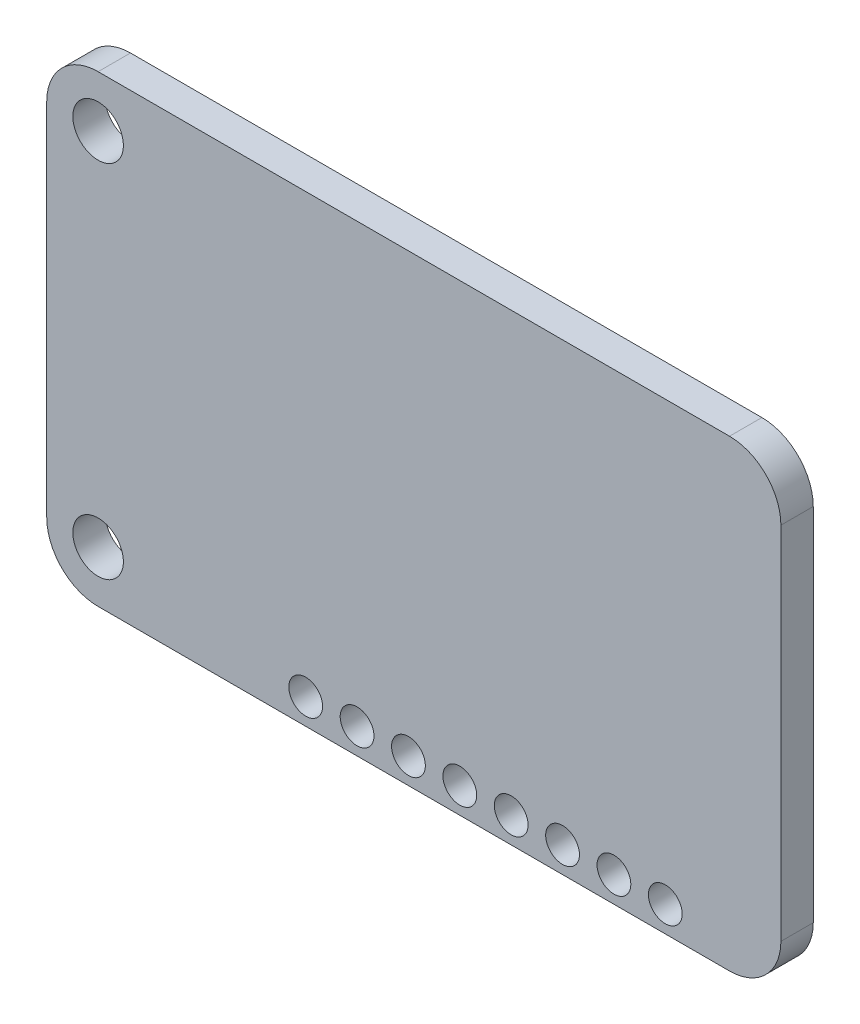
ISO-10303-21;
HEADER;
FILE_DESCRIPTION(('STEP AP214'),'2;1');
FILE_NAME('part.step','',(''),(''),'','','');
FILE_SCHEMA(('AUTOMOTIVE_DESIGN { 1 0 10303 214 1 1 1 1 }'));
ENDSEC;
DATA;
#1=APPLICATION_CONTEXT('core data for automotive mechanical design processes');
#2=APPLICATION_PROTOCOL_DEFINITION('international standard','automotive_design',2000,#1);
#3=PRODUCT_CONTEXT('',#1,'mechanical');
#4=PRODUCT('Part','Part','',(#3));
#5=PRODUCT_RELATED_PRODUCT_CATEGORY('part','',(#4));
#6=PRODUCT_DEFINITION_FORMATION('','',#4);
#7=PRODUCT_DEFINITION_CONTEXT('part definition',#1,'design');
#8=PRODUCT_DEFINITION('design','',#6,#7);
#9=PRODUCT_DEFINITION_SHAPE('','',#8);
#10=(LENGTH_UNIT() NAMED_UNIT(*) SI_UNIT(.MILLI.,.METRE.));
#11=(NAMED_UNIT(*) PLANE_ANGLE_UNIT() SI_UNIT($,.RADIAN.));
#12=(NAMED_UNIT(*) SI_UNIT($,.STERADIAN.) SOLID_ANGLE_UNIT());
#13=UNCERTAINTY_MEASURE_WITH_UNIT(LENGTH_MEASURE(1.E-05),#10,'distance_accuracy_value','');
#14=(GEOMETRIC_REPRESENTATION_CONTEXT(3) GLOBAL_UNCERTAINTY_ASSIGNED_CONTEXT((#13)) GLOBAL_UNIT_ASSIGNED_CONTEXT((#10,
#11,#12)) REPRESENTATION_CONTEXT('',''));
#15=CARTESIAN_POINT('',(0.,0.,0.));
#16=DIRECTION('',(0.,0.,1.));
#17=DIRECTION('',(1.,0.,0.));
#18=AXIS2_PLACEMENT_3D('',#15,#16,#17);
#19=CARTESIAN_POINT('',(15.61,-8.91,1.6));
#20=DIRECTION('',(0.,0.,1.));
#21=DIRECTION('',(1.,0.,0.));
#22=AXIS2_PLACEMENT_3D('',#19,#20,#21);
#23=PLANE('',#22);
#24=CARTESIAN_POINT('',(12.4347,-10.18,1.6));
#25=DIRECTION('',(0.,0.,1.));
#26=DIRECTION('',(1.,0.,0.));
#27=AXIS2_PLACEMENT_3D('',#24,#25,#26);
#28=CIRCLE('',#27,0.835000000000003);
#29=CARTESIAN_POINT('',(13.2697,-10.18,1.6));
#30=VERTEX_POINT('',#29);
#31=EDGE_CURVE('E163',#30,#30,#28,.T.);
#32=ORIENTED_EDGE('',*,*,#31,.F.);
#33=EDGE_LOOP('',(#32));
#34=FACE_BOUND('',#33,.T.);
#35=CARTESIAN_POINT('',(9.8947,-10.18,1.6));
#36=DIRECTION('',(0.,0.,1.));
#37=DIRECTION('',(1.,0.,0.));
#38=AXIS2_PLACEMENT_3D('',#35,#36,#37);
#39=CIRCLE('',#38,0.835000000000003);
#40=CARTESIAN_POINT('',(10.7297,-10.18,1.6));
#41=VERTEX_POINT('',#40);
#42=EDGE_CURVE('E282',#41,#41,#39,.T.);
#43=ORIENTED_EDGE('',*,*,#42,.F.);
#44=EDGE_LOOP('',(#43));
#45=FACE_BOUND('',#44,.T.);
#46=CARTESIAN_POINT('',(7.3547,-10.18,1.6));
#47=DIRECTION('',(0.,0.,1.));
#48=DIRECTION('',(1.,0.,0.));
#49=AXIS2_PLACEMENT_3D('',#46,#47,#48);
#50=CIRCLE('',#49,0.835000000000004);
#51=CARTESIAN_POINT('',(8.18970000000001,-10.18,1.6));
#52=VERTEX_POINT('',#51);
#53=EDGE_CURVE('E285',#52,#52,#50,.T.);
#54=ORIENTED_EDGE('',*,*,#53,.F.);
#55=EDGE_LOOP('',(#54));
#56=FACE_BOUND('',#55,.T.);
#57=CARTESIAN_POINT('',(4.8147,-10.18,1.6));
#58=DIRECTION('',(0.,0.,1.));
#59=DIRECTION('',(1.,0.,0.));
#60=AXIS2_PLACEMENT_3D('',#57,#58,#59);
#61=CIRCLE('',#60,0.835000000000003);
#62=CARTESIAN_POINT('',(5.64970000000001,-10.18,1.6));
#63=VERTEX_POINT('',#62);
#64=EDGE_CURVE('E290',#63,#63,#61,.T.);
#65=ORIENTED_EDGE('',*,*,#64,.F.);
#66=EDGE_LOOP('',(#65));
#67=FACE_BOUND('',#66,.T.);
#68=CARTESIAN_POINT('',(2.2747,-10.18,1.6));
#69=DIRECTION('',(0.,0.,1.));
#70=DIRECTION('',(1.,0.,0.));
#71=AXIS2_PLACEMENT_3D('',#68,#69,#70);
#72=CIRCLE('',#71,0.835000000000003);
#73=CARTESIAN_POINT('',(3.10970000000001,-10.18,1.6));
#74=VERTEX_POINT('',#73);
#75=EDGE_CURVE('E293',#74,#74,#72,.T.);
#76=ORIENTED_EDGE('',*,*,#75,.F.);
#77=EDGE_LOOP('',(#76));
#78=FACE_BOUND('',#77,.T.);
#79=CARTESIAN_POINT('',(-0.265299999999998,-10.18,1.6));
#80=DIRECTION('',(0.,0.,1.));
#81=DIRECTION('',(1.,0.,0.));
#82=AXIS2_PLACEMENT_3D('',#79,#80,#81);
#83=CIRCLE('',#82,0.835000000000003);
#84=CARTESIAN_POINT('',(0.569700000000005,-10.18,1.6));
#85=VERTEX_POINT('',#84);
#86=EDGE_CURVE('E296',#85,#85,#83,.T.);
#87=ORIENTED_EDGE('',*,*,#86,.F.);
#88=EDGE_LOOP('',(#87));
#89=FACE_BOUND('',#88,.T.);
#90=CARTESIAN_POINT('',(-2.8053,-10.18,1.6));
#91=DIRECTION('',(0.,0.,1.));
#92=DIRECTION('',(1.,0.,0.));
#93=AXIS2_PLACEMENT_3D('',#90,#91,#92);
#94=CIRCLE('',#93,0.835000000000003);
#95=CARTESIAN_POINT('',(-1.97029999999999,-10.18,1.6));
#96=VERTEX_POINT('',#95);
#97=EDGE_CURVE('E299',#96,#96,#94,.T.);
#98=ORIENTED_EDGE('',*,*,#97,.F.);
#99=EDGE_LOOP('',(#98));
#100=FACE_BOUND('',#99,.T.);
#101=CARTESIAN_POINT('',(-5.3453,-10.18,1.6));
#102=DIRECTION('',(0.,0.,1.));
#103=DIRECTION('',(1.,0.,0.));
#104=AXIS2_PLACEMENT_3D('',#101,#102,#103);
#105=CIRCLE('',#104,0.835000000000003);
#106=CARTESIAN_POINT('',(-4.51029999999999,-10.18,1.6));
#107=VERTEX_POINT('',#106);
#108=EDGE_CURVE('E301',#107,#107,#105,.T.);
#109=ORIENTED_EDGE('',*,*,#108,.F.);
#110=EDGE_LOOP('',(#109));
#111=FACE_BOUND('',#110,.T.);
#112=CARTESIAN_POINT('',(-15.61,8.91,1.6));
#113=DIRECTION('',(0.,0.,1.));
#114=DIRECTION('',(1.,0.,0.));
#115=AXIS2_PLACEMENT_3D('',#112,#113,#114);
#116=CIRCLE('',#115,1.25);
#117=CARTESIAN_POINT('',(-14.36,8.91,1.6));
#118=VERTEX_POINT('',#117);
#119=EDGE_CURVE('E136',#118,#118,#116,.T.);
#120=ORIENTED_EDGE('',*,*,#119,.F.);
#121=EDGE_LOOP('',(#120));
#122=FACE_BOUND('',#121,.T.);
#123=CARTESIAN_POINT('',(15.61,-8.91,1.6));
#124=DIRECTION('',(0.,0.,1.));
#125=DIRECTION('',(1.,0.,0.));
#126=AXIS2_PLACEMENT_3D('',#123,#124,#125);
#127=CIRCLE('',#126,2.54);
#128=CARTESIAN_POINT('',(15.61,-11.45,1.6));
#129=VERTEX_POINT('',#128);
#130=CARTESIAN_POINT('',(18.15,-8.90999999999998,1.6));
#131=VERTEX_POINT('',#130);
#132=EDGE_CURVE('E147',#129,#131,#127,.T.);
#133=ORIENTED_EDGE('',*,*,#132,.T.);
#134=DIRECTION('',(0.,1.,0.));
#135=VECTOR('',#134,1.);
#136=CARTESIAN_POINT('',(18.15,-8.90999999999998,1.6));
#137=LINE('',#136,#135);
#138=CARTESIAN_POINT('',(18.15,8.90999999999998,1.6));
#139=VERTEX_POINT('',#138);
#140=EDGE_CURVE('E95',#131,#139,#137,.T.);
#141=ORIENTED_EDGE('',*,*,#140,.T.);
#142=CARTESIAN_POINT('',(15.61,8.91,1.6));
#143=DIRECTION('',(0.,0.,1.));
#144=DIRECTION('',(-1.,0.,0.));
#145=AXIS2_PLACEMENT_3D('',#142,#143,#144);
#146=CIRCLE('',#145,2.54);
#147=CARTESIAN_POINT('',(15.61,11.45,1.6));
#148=VERTEX_POINT('',#147);
#149=EDGE_CURVE('E201',#139,#148,#146,.T.);
#150=ORIENTED_EDGE('',*,*,#149,.T.);
#151=DIRECTION('',(-1.,0.,0.));
#152=VECTOR('',#151,1.);
#153=CARTESIAN_POINT('',(15.61,11.45,1.6));
#154=LINE('',#153,#152);
#155=CARTESIAN_POINT('',(-15.61,11.45,1.6));
#156=VERTEX_POINT('',#155);
#157=EDGE_CURVE('E203',#148,#156,#154,.T.);
#158=ORIENTED_EDGE('',*,*,#157,.T.);
#159=CARTESIAN_POINT('',(-15.61,8.91,1.6));
#160=DIRECTION('',(0.,0.,1.));
#161=DIRECTION('',(-1.,0.,0.));
#162=AXIS2_PLACEMENT_3D('',#159,#160,#161);
#163=CIRCLE('',#162,2.54);
#164=CARTESIAN_POINT('',(-18.15,8.90999999999998,1.6));
#165=VERTEX_POINT('',#164);
#166=EDGE_CURVE('E114',#156,#165,#163,.T.);
#167=ORIENTED_EDGE('',*,*,#166,.T.);
#168=DIRECTION('',(0.,-1.,0.));
#169=VECTOR('',#168,1.);
#170=CARTESIAN_POINT('',(-18.15,-8.90999999999998,1.6));
#171=LINE('',#170,#169);
#172=CARTESIAN_POINT('',(-18.15,-8.90999999999998,1.6));
#173=VERTEX_POINT('',#172);
#174=EDGE_CURVE('E108',#165,#173,#171,.T.);
#175=ORIENTED_EDGE('',*,*,#174,.T.);
#176=CARTESIAN_POINT('',(-15.61,-8.91,1.6));
#177=DIRECTION('',(0.,0.,1.));
#178=DIRECTION('',(1.,0.,0.));
#179=AXIS2_PLACEMENT_3D('',#176,#177,#178);
#180=CIRCLE('',#179,2.54);
#181=CARTESIAN_POINT('',(-15.61,-11.45,1.6));
#182=VERTEX_POINT('',#181);
#183=EDGE_CURVE('E112',#173,#182,#180,.T.);
#184=ORIENTED_EDGE('',*,*,#183,.T.);
#185=DIRECTION('',(1.,0.,0.));
#186=VECTOR('',#185,1.);
#187=CARTESIAN_POINT('',(15.61,-11.45,1.6));
#188=LINE('',#187,#186);
#189=EDGE_CURVE('E52',#182,#129,#188,.T.);
#190=ORIENTED_EDGE('',*,*,#189,.T.);
#191=EDGE_LOOP('',(#133,#141,#150,#158,#167,#175,#184,#190));
#192=FACE_BOUND('',#191,.T.);
#193=CARTESIAN_POINT('',(-15.61,-8.91,1.6));
#194=DIRECTION('',(0.,0.,1.));
#195=DIRECTION('',(1.,0.,0.));
#196=AXIS2_PLACEMENT_3D('',#193,#194,#195);
#197=CIRCLE('',#196,1.25);
#198=CARTESIAN_POINT('',(-14.36,-8.91,1.6));
#199=VERTEX_POINT('',#198);
#200=EDGE_CURVE('E186',#199,#199,#197,.T.);
#201=ORIENTED_EDGE('',*,*,#200,.F.);
#202=EDGE_LOOP('',(#201));
#203=FACE_BOUND('',#202,.T.);
#204=ADVANCED_FACE('F33',(#34,#45,#56,#67,#78,#89,#100,#111,#122,#192,#203),#23,.T.);
#205=CARTESIAN_POINT('',(15.61,-8.91,0.));
#206=DIRECTION('',(0.,0.,1.));
#207=DIRECTION('',(1.,0.,0.));
#208=AXIS2_PLACEMENT_3D('',#205,#206,#207);
#209=PLANE('',#208);
#210=CARTESIAN_POINT('',(12.4347,-10.18,0.));
#211=DIRECTION('',(0.,0.,1.));
#212=DIRECTION('',(1.,0.,0.));
#213=AXIS2_PLACEMENT_3D('',#210,#211,#212);
#214=CIRCLE('',#213,0.835000000000003);
#215=CARTESIAN_POINT('',(13.2697,-10.18,0.));
#216=VERTEX_POINT('',#215);
#217=EDGE_CURVE('E37',#216,#216,#214,.T.);
#218=ORIENTED_EDGE('',*,*,#217,.T.);
#219=EDGE_LOOP('',(#218));
#220=FACE_BOUND('',#219,.T.);
#221=CARTESIAN_POINT('',(9.8947,-10.18,0.));
#222=DIRECTION('',(0.,0.,1.));
#223=DIRECTION('',(1.,0.,0.));
#224=AXIS2_PLACEMENT_3D('',#221,#222,#223);
#225=CIRCLE('',#224,0.835000000000003);
#226=CARTESIAN_POINT('',(10.7297,-10.18,0.));
#227=VERTEX_POINT('',#226);
#228=EDGE_CURVE('E177',#227,#227,#225,.T.);
#229=ORIENTED_EDGE('',*,*,#228,.T.);
#230=EDGE_LOOP('',(#229));
#231=FACE_BOUND('',#230,.T.);
#232=CARTESIAN_POINT('',(7.3547,-10.18,0.));
#233=DIRECTION('',(0.,0.,1.));
#234=DIRECTION('',(1.,0.,0.));
#235=AXIS2_PLACEMENT_3D('',#232,#233,#234);
#236=CIRCLE('',#235,0.835000000000004);
#237=CARTESIAN_POINT('',(8.18970000000001,-10.18,0.));
#238=VERTEX_POINT('',#237);
#239=EDGE_CURVE('E175',#238,#238,#236,.T.);
#240=ORIENTED_EDGE('',*,*,#239,.T.);
#241=EDGE_LOOP('',(#240));
#242=FACE_BOUND('',#241,.T.);
#243=CARTESIAN_POINT('',(4.8147,-10.18,0.));
#244=DIRECTION('',(0.,0.,1.));
#245=DIRECTION('',(1.,0.,0.));
#246=AXIS2_PLACEMENT_3D('',#243,#244,#245);
#247=CIRCLE('',#246,0.835000000000003);
#248=CARTESIAN_POINT('',(5.64970000000001,-10.18,0.));
#249=VERTEX_POINT('',#248);
#250=EDGE_CURVE('E172',#249,#249,#247,.T.);
#251=ORIENTED_EDGE('',*,*,#250,.T.);
#252=EDGE_LOOP('',(#251));
#253=FACE_BOUND('',#252,.T.);
#254=CARTESIAN_POINT('',(2.2747,-10.18,0.));
#255=DIRECTION('',(0.,0.,1.));
#256=DIRECTION('',(1.,0.,0.));
#257=AXIS2_PLACEMENT_3D('',#254,#255,#256);
#258=CIRCLE('',#257,0.835000000000003);
#259=CARTESIAN_POINT('',(3.10970000000001,-10.18,0.));
#260=VERTEX_POINT('',#259);
#261=EDGE_CURVE('E169',#260,#260,#258,.T.);
#262=ORIENTED_EDGE('',*,*,#261,.T.);
#263=EDGE_LOOP('',(#262));
#264=FACE_BOUND('',#263,.T.);
#265=CARTESIAN_POINT('',(-0.265299999999998,-10.18,0.));
#266=DIRECTION('',(0.,0.,1.));
#267=DIRECTION('',(1.,0.,0.));
#268=AXIS2_PLACEMENT_3D('',#265,#266,#267);
#269=CIRCLE('',#268,0.835000000000003);
#270=CARTESIAN_POINT('',(0.569700000000005,-10.18,0.));
#271=VERTEX_POINT('',#270);
#272=EDGE_CURVE('E166',#271,#271,#269,.T.);
#273=ORIENTED_EDGE('',*,*,#272,.T.);
#274=EDGE_LOOP('',(#273));
#275=FACE_BOUND('',#274,.T.);
#276=CARTESIAN_POINT('',(-2.8053,-10.18,0.));
#277=DIRECTION('',(0.,0.,1.));
#278=DIRECTION('',(1.,0.,0.));
#279=AXIS2_PLACEMENT_3D('',#276,#277,#278);
#280=CIRCLE('',#279,0.835000000000003);
#281=CARTESIAN_POINT('',(-1.97029999999999,-10.18,0.));
#282=VERTEX_POINT('',#281);
#283=EDGE_CURVE('E162',#282,#282,#280,.T.);
#284=ORIENTED_EDGE('',*,*,#283,.T.);
#285=EDGE_LOOP('',(#284));
#286=FACE_BOUND('',#285,.T.);
#287=CARTESIAN_POINT('',(-5.3453,-10.18,0.));
#288=DIRECTION('',(0.,0.,1.));
#289=DIRECTION('',(1.,0.,0.));
#290=AXIS2_PLACEMENT_3D('',#287,#288,#289);
#291=CIRCLE('',#290,0.835000000000003);
#292=CARTESIAN_POINT('',(-4.51029999999999,-10.18,0.));
#293=VERTEX_POINT('',#292);
#294=EDGE_CURVE('E159',#293,#293,#291,.T.);
#295=ORIENTED_EDGE('',*,*,#294,.T.);
#296=EDGE_LOOP('',(#295));
#297=FACE_BOUND('',#296,.T.);
#298=CARTESIAN_POINT('',(15.61,-8.91,0.));
#299=DIRECTION('',(0.,0.,1.));
#300=DIRECTION('',(1.,0.,0.));
#301=AXIS2_PLACEMENT_3D('',#298,#299,#300);
#302=CIRCLE('',#301,2.54);
#303=CARTESIAN_POINT('',(15.61,-11.45,0.));
#304=VERTEX_POINT('',#303);
#305=CARTESIAN_POINT('',(18.15,-8.90999999999998,0.));
#306=VERTEX_POINT('',#305);
#307=EDGE_CURVE('E132',#304,#306,#302,.T.);
#308=ORIENTED_EDGE('',*,*,#307,.F.);
#309=DIRECTION('',(1.,0.,0.));
#310=VECTOR('',#309,1.);
#311=CARTESIAN_POINT('',(15.61,-11.45,0.));
#312=LINE('',#311,#310);
#313=CARTESIAN_POINT('',(-15.61,-11.45,0.));
#314=VERTEX_POINT('',#313);
#315=EDGE_CURVE('E87',#314,#304,#312,.T.);
#316=ORIENTED_EDGE('',*,*,#315,.F.);
#317=CARTESIAN_POINT('',(-15.61,-8.91,0.));
#318=DIRECTION('',(0.,0.,1.));
#319=DIRECTION('',(1.,0.,0.));
#320=AXIS2_PLACEMENT_3D('',#317,#318,#319);
#321=CIRCLE('',#320,2.54);
#322=CARTESIAN_POINT('',(-18.15,-8.90999999999998,0.));
#323=VERTEX_POINT('',#322);
#324=EDGE_CURVE('E81',#323,#314,#321,.T.);
#325=ORIENTED_EDGE('',*,*,#324,.F.);
#326=DIRECTION('',(0.,-1.,0.));
#327=VECTOR('',#326,1.);
#328=CARTESIAN_POINT('',(-18.15,-8.90999999999998,0.));
#329=LINE('',#328,#327);
#330=CARTESIAN_POINT('',(-18.15,8.90999999999998,0.));
#331=VERTEX_POINT('',#330);
#332=EDGE_CURVE('E122',#331,#323,#329,.T.);
#333=ORIENTED_EDGE('',*,*,#332,.F.);
#334=CARTESIAN_POINT('',(-15.61,8.91,0.));
#335=DIRECTION('',(0.,0.,1.));
#336=DIRECTION('',(-1.,0.,0.));
#337=AXIS2_PLACEMENT_3D('',#334,#335,#336);
#338=CIRCLE('',#337,2.54);
#339=CARTESIAN_POINT('',(-15.61,11.45,0.));
#340=VERTEX_POINT('',#339);
#341=EDGE_CURVE('E142',#340,#331,#338,.T.);
#342=ORIENTED_EDGE('',*,*,#341,.F.);
#343=DIRECTION('',(-1.,0.,0.));
#344=VECTOR('',#343,1.);
#345=CARTESIAN_POINT('',(15.61,11.45,0.));
#346=LINE('',#345,#344);
#347=CARTESIAN_POINT('',(15.61,11.45,0.));
#348=VERTEX_POINT('',#347);
#349=EDGE_CURVE('E140',#348,#340,#346,.T.);
#350=ORIENTED_EDGE('',*,*,#349,.F.);
#351=CARTESIAN_POINT('',(15.61,8.91,0.));
#352=DIRECTION('',(0.,0.,1.));
#353=DIRECTION('',(-1.,0.,0.));
#354=AXIS2_PLACEMENT_3D('',#351,#352,#353);
#355=CIRCLE('',#354,2.54);
#356=CARTESIAN_POINT('',(18.15,8.90999999999998,0.));
#357=VERTEX_POINT('',#356);
#358=EDGE_CURVE('E138',#357,#348,#355,.T.);
#359=ORIENTED_EDGE('',*,*,#358,.F.);
#360=DIRECTION('',(0.,1.,0.));
#361=VECTOR('',#360,1.);
#362=CARTESIAN_POINT('',(18.15,-8.90999999999998,0.));
#363=LINE('',#362,#361);
#364=EDGE_CURVE('E135',#306,#357,#363,.T.);
#365=ORIENTED_EDGE('',*,*,#364,.F.);
#366=EDGE_LOOP('',(#308,#316,#325,#333,#342,#350,#359,#365));
#367=FACE_BOUND('',#366,.T.);
#368=CARTESIAN_POINT('',(-15.61,8.91,0.));
#369=DIRECTION('',(0.,0.,1.));
#370=DIRECTION('',(1.,0.,0.));
#371=AXIS2_PLACEMENT_3D('',#368,#369,#370);
#372=CIRCLE('',#371,1.25);
#373=CARTESIAN_POINT('',(-14.36,8.91,0.));
#374=VERTEX_POINT('',#373);
#375=EDGE_CURVE('E191',#374,#374,#372,.T.);
#376=ORIENTED_EDGE('',*,*,#375,.T.);
#377=EDGE_LOOP('',(#376));
#378=FACE_BOUND('',#377,.T.);
#379=CARTESIAN_POINT('',(-15.61,-8.91,0.));
#380=DIRECTION('',(0.,0.,1.));
#381=DIRECTION('',(1.,0.,0.));
#382=AXIS2_PLACEMENT_3D('',#379,#380,#381);
#383=CIRCLE('',#382,1.25);
#384=CARTESIAN_POINT('',(-14.36,-8.91,0.));
#385=VERTEX_POINT('',#384);
#386=EDGE_CURVE('E182',#385,#385,#383,.T.);
#387=ORIENTED_EDGE('',*,*,#386,.T.);
#388=EDGE_LOOP('',(#387));
#389=FACE_BOUND('',#388,.T.);
#390=ADVANCED_FACE('F216',(#220,#231,#242,#253,#264,#275,#286,#297,#367,#378,#389),#209,.F.);
#391=CARTESIAN_POINT('',(15.61,-8.91,1.6));
#392=DIRECTION('',(0.,0.,-1.));
#393=DIRECTION('',(-1.,0.,0.));
#394=AXIS2_PLACEMENT_3D('',#391,#392,#393);
#395=CYLINDRICAL_SURFACE('',#394,2.54);
#396=ORIENTED_EDGE('',*,*,#307,.T.);
#397=DIRECTION('',(0.,0.,-1.));
#398=VECTOR('',#397,1.);
#399=CARTESIAN_POINT('',(18.15,-8.90999999999998,1.6));
#400=LINE('',#399,#398);
#401=EDGE_CURVE('E11',#131,#306,#400,.T.);
#402=ORIENTED_EDGE('',*,*,#401,.F.);
#403=ORIENTED_EDGE('',*,*,#132,.F.);
#404=DIRECTION('',(0.,0.,-1.));
#405=VECTOR('',#404,1.);
#406=CARTESIAN_POINT('',(15.61,-11.45,1.6));
#407=LINE('',#406,#405);
#408=EDGE_CURVE('E128',#129,#304,#407,.T.);
#409=ORIENTED_EDGE('',*,*,#408,.T.);
#410=EDGE_LOOP('',(#396,#402,#403,#409));
#411=FACE_BOUND('',#410,.T.);
#412=ADVANCED_FACE('F35',(#411),#395,.T.);
#413=CARTESIAN_POINT('',(18.15,-8.90999999999998,1.6));
#414=DIRECTION('',(-1.,0.,0.));
#415=DIRECTION('',(0.,0.,1.));
#416=AXIS2_PLACEMENT_3D('',#413,#414,#415);
#417=PLANE('',#416);
#418=ORIENTED_EDGE('',*,*,#364,.T.);
#419=DIRECTION('',(0.,0.,-1.));
#420=VECTOR('',#419,1.);
#421=CARTESIAN_POINT('',(18.15,8.90999999999998,1.6));
#422=LINE('',#421,#420);
#423=EDGE_CURVE('E43',#139,#357,#422,.T.);
#424=ORIENTED_EDGE('',*,*,#423,.F.);
#425=ORIENTED_EDGE('',*,*,#140,.F.);
#426=ORIENTED_EDGE('',*,*,#401,.T.);
#427=EDGE_LOOP('',(#418,#424,#425,#426));
#428=FACE_BOUND('',#427,.T.);
#429=ADVANCED_FACE('F420',(#428),#417,.F.);
#430=CARTESIAN_POINT('',(15.61,8.91,1.6));
#431=DIRECTION('',(0.,0.,-1.));
#432=DIRECTION('',(-1.,0.,0.));
#433=AXIS2_PLACEMENT_3D('',#430,#431,#432);
#434=CYLINDRICAL_SURFACE('',#433,2.54);
#435=ORIENTED_EDGE('',*,*,#358,.T.);
#436=DIRECTION('',(0.,0.,-1.));
#437=VECTOR('',#436,1.);
#438=CARTESIAN_POINT('',(15.61,11.45,1.6));
#439=LINE('',#438,#437);
#440=EDGE_CURVE('E154',#148,#348,#439,.T.);
#441=ORIENTED_EDGE('',*,*,#440,.F.);
#442=ORIENTED_EDGE('',*,*,#149,.F.);
#443=ORIENTED_EDGE('',*,*,#423,.T.);
#444=EDGE_LOOP('',(#435,#441,#442,#443));
#445=FACE_BOUND('',#444,.T.);
#446=ADVANCED_FACE('F411',(#445),#434,.T.);
#447=CARTESIAN_POINT('',(15.61,11.45,1.6));
#448=DIRECTION('',(0.,-1.,0.));
#449=DIRECTION('',(1.,0.,0.));
#450=AXIS2_PLACEMENT_3D('',#447,#448,#449);
#451=PLANE('',#450);
#452=ORIENTED_EDGE('',*,*,#349,.T.);
#453=DIRECTION('',(0.,0.,-1.));
#454=VECTOR('',#453,1.);
#455=CARTESIAN_POINT('',(-15.61,11.45,1.6));
#456=LINE('',#455,#454);
#457=EDGE_CURVE('E151',#156,#340,#456,.T.);
#458=ORIENTED_EDGE('',*,*,#457,.F.);
#459=ORIENTED_EDGE('',*,*,#157,.F.);
#460=ORIENTED_EDGE('',*,*,#440,.T.);
#461=EDGE_LOOP('',(#452,#458,#459,#460));
#462=FACE_BOUND('',#461,.T.);
#463=ADVANCED_FACE('F209',(#462),#451,.F.);
#464=CARTESIAN_POINT('',(-15.61,8.91,1.6));
#465=DIRECTION('',(0.,0.,-1.));
#466=DIRECTION('',(-1.,0.,0.));
#467=AXIS2_PLACEMENT_3D('',#464,#465,#466);
#468=CYLINDRICAL_SURFACE('',#467,2.54);
#469=ORIENTED_EDGE('',*,*,#341,.T.);
#470=DIRECTION('',(0.,0.,-1.));
#471=VECTOR('',#470,1.);
#472=CARTESIAN_POINT('',(-18.15,8.90999999999998,1.6));
#473=LINE('',#472,#471);
#474=EDGE_CURVE('E123',#165,#331,#473,.T.);
#475=ORIENTED_EDGE('',*,*,#474,.F.);
#476=ORIENTED_EDGE('',*,*,#166,.F.);
#477=ORIENTED_EDGE('',*,*,#457,.T.);
#478=EDGE_LOOP('',(#469,#475,#476,#477));
#479=FACE_BOUND('',#478,.T.);
#480=ADVANCED_FACE('F213',(#479),#468,.T.);
#481=CARTESIAN_POINT('',(-18.15,-8.90999999999998,1.6));
#482=DIRECTION('',(1.,0.,0.));
#483=DIRECTION('',(0.,0.,-1.));
#484=AXIS2_PLACEMENT_3D('',#481,#482,#483);
#485=PLANE('',#484);
#486=ORIENTED_EDGE('',*,*,#332,.T.);
#487=DIRECTION('',(0.,0.,-1.));
#488=VECTOR('',#487,1.);
#489=CARTESIAN_POINT('',(-18.15,-8.90999999999998,1.6));
#490=LINE('',#489,#488);
#491=EDGE_CURVE('E119',#173,#323,#490,.T.);
#492=ORIENTED_EDGE('',*,*,#491,.F.);
#493=ORIENTED_EDGE('',*,*,#174,.F.);
#494=ORIENTED_EDGE('',*,*,#474,.T.);
#495=EDGE_LOOP('',(#486,#492,#493,#494));
#496=FACE_BOUND('',#495,.T.);
#497=ADVANCED_FACE('F120',(#496),#485,.F.);
#498=CARTESIAN_POINT('',(-15.61,-8.91,1.6));
#499=DIRECTION('',(0.,0.,-1.));
#500=DIRECTION('',(-1.,0.,0.));
#501=AXIS2_PLACEMENT_3D('',#498,#499,#500);
#502=CYLINDRICAL_SURFACE('',#501,2.54);
#503=ORIENTED_EDGE('',*,*,#324,.T.);
#504=DIRECTION('',(0.,0.,-1.));
#505=VECTOR('',#504,1.);
#506=CARTESIAN_POINT('',(-15.61,-11.45,1.6));
#507=LINE('',#506,#505);
#508=EDGE_CURVE('E124',#182,#314,#507,.T.);
#509=ORIENTED_EDGE('',*,*,#508,.F.);
#510=ORIENTED_EDGE('',*,*,#183,.F.);
#511=ORIENTED_EDGE('',*,*,#491,.T.);
#512=EDGE_LOOP('',(#503,#509,#510,#511));
#513=FACE_BOUND('',#512,.T.);
#514=ADVANCED_FACE('F126',(#513),#502,.T.);
#515=CARTESIAN_POINT('',(15.61,-11.45,1.6));
#516=DIRECTION('',(0.,1.,0.));
#517=DIRECTION('',(-1.,0.,0.));
#518=AXIS2_PLACEMENT_3D('',#515,#516,#517);
#519=PLANE('',#518);
#520=ORIENTED_EDGE('',*,*,#315,.T.);
#521=ORIENTED_EDGE('',*,*,#408,.F.);
#522=ORIENTED_EDGE('',*,*,#189,.F.);
#523=ORIENTED_EDGE('',*,*,#508,.T.);
#524=EDGE_LOOP('',(#520,#521,#522,#523));
#525=FACE_BOUND('',#524,.T.);
#526=ADVANCED_FACE('F222',(#525),#519,.F.);
#527=CARTESIAN_POINT('',(-15.61,8.91,1.6));
#528=DIRECTION('',(0.,0.,-1.));
#529=DIRECTION('',(-1.,0.,0.));
#530=AXIS2_PLACEMENT_3D('',#527,#528,#529);
#531=CYLINDRICAL_SURFACE('',#530,1.25);
#532=ORIENTED_EDGE('',*,*,#119,.T.);
#533=EDGE_LOOP('',(#532));
#534=FACE_BOUND('',#533,.T.);
#535=ORIENTED_EDGE('',*,*,#375,.F.);
#536=EDGE_LOOP('',(#535));
#537=FACE_BOUND('',#536,.T.);
#538=ADVANCED_FACE('F224',(#534,#537),#531,.F.);
#539=CARTESIAN_POINT('',(-15.61,-8.91,1.6));
#540=DIRECTION('',(0.,0.,-1.));
#541=DIRECTION('',(-1.,0.,0.));
#542=AXIS2_PLACEMENT_3D('',#539,#540,#541);
#543=CYLINDRICAL_SURFACE('',#542,1.25);
#544=ORIENTED_EDGE('',*,*,#200,.T.);
#545=EDGE_LOOP('',(#544));
#546=FACE_BOUND('',#545,.T.);
#547=ORIENTED_EDGE('',*,*,#386,.F.);
#548=EDGE_LOOP('',(#547));
#549=FACE_BOUND('',#548,.T.);
#550=ADVANCED_FACE('F230',(#546,#549),#543,.F.);
#551=CARTESIAN_POINT('',(-5.3453,-10.18,-8.4));
#552=DIRECTION('',(0.,0.,1.));
#553=DIRECTION('',(1.,0.,0.));
#554=AXIS2_PLACEMENT_3D('',#551,#552,#553);
#555=CYLINDRICAL_SURFACE('',#554,0.835000000000003);
#556=ORIENTED_EDGE('',*,*,#108,.T.);
#557=EDGE_LOOP('',(#556));
#558=FACE_BOUND('',#557,.T.);
#559=ORIENTED_EDGE('',*,*,#294,.F.);
#560=EDGE_LOOP('',(#559));
#561=FACE_BOUND('',#560,.T.);
#562=ADVANCED_FACE('F246',(#558,#561),#555,.F.);
#563=CARTESIAN_POINT('',(-2.8053,-10.18,-8.4));
#564=DIRECTION('',(0.,0.,1.));
#565=DIRECTION('',(1.,0.,0.));
#566=AXIS2_PLACEMENT_3D('',#563,#564,#565);
#567=CYLINDRICAL_SURFACE('',#566,0.835000000000003);
#568=ORIENTED_EDGE('',*,*,#97,.T.);
#569=EDGE_LOOP('',(#568));
#570=FACE_BOUND('',#569,.T.);
#571=ORIENTED_EDGE('',*,*,#283,.F.);
#572=EDGE_LOOP('',(#571));
#573=FACE_BOUND('',#572,.T.);
#574=ADVANCED_FACE('F250',(#570,#573),#567,.F.);
#575=CARTESIAN_POINT('',(-0.265299999999998,-10.18,-8.4));
#576=DIRECTION('',(0.,0.,1.));
#577=DIRECTION('',(1.,0.,0.));
#578=AXIS2_PLACEMENT_3D('',#575,#576,#577);
#579=CYLINDRICAL_SURFACE('',#578,0.835000000000003);
#580=ORIENTED_EDGE('',*,*,#86,.T.);
#581=EDGE_LOOP('',(#580));
#582=FACE_BOUND('',#581,.T.);
#583=ORIENTED_EDGE('',*,*,#272,.F.);
#584=EDGE_LOOP('',(#583));
#585=FACE_BOUND('',#584,.T.);
#586=ADVANCED_FACE('F254',(#582,#585),#579,.F.);
#587=CARTESIAN_POINT('',(2.2747,-10.18,-8.4));
#588=DIRECTION('',(0.,0.,1.));
#589=DIRECTION('',(1.,0.,0.));
#590=AXIS2_PLACEMENT_3D('',#587,#588,#589);
#591=CYLINDRICAL_SURFACE('',#590,0.835000000000003);
#592=ORIENTED_EDGE('',*,*,#75,.T.);
#593=EDGE_LOOP('',(#592));
#594=FACE_BOUND('',#593,.T.);
#595=ORIENTED_EDGE('',*,*,#261,.F.);
#596=EDGE_LOOP('',(#595));
#597=FACE_BOUND('',#596,.T.);
#598=ADVANCED_FACE('F258',(#594,#597),#591,.F.);
#599=CARTESIAN_POINT('',(4.8147,-10.18,-8.4));
#600=DIRECTION('',(0.,0.,1.));
#601=DIRECTION('',(1.,0.,0.));
#602=AXIS2_PLACEMENT_3D('',#599,#600,#601);
#603=CYLINDRICAL_SURFACE('',#602,0.835000000000003);
#604=ORIENTED_EDGE('',*,*,#64,.T.);
#605=EDGE_LOOP('',(#604));
#606=FACE_BOUND('',#605,.T.);
#607=ORIENTED_EDGE('',*,*,#250,.F.);
#608=EDGE_LOOP('',(#607));
#609=FACE_BOUND('',#608,.T.);
#610=ADVANCED_FACE('F262',(#606,#609),#603,.F.);
#611=CARTESIAN_POINT('',(7.3547,-10.18,-8.4));
#612=DIRECTION('',(0.,0.,1.));
#613=DIRECTION('',(1.,0.,0.));
#614=AXIS2_PLACEMENT_3D('',#611,#612,#613);
#615=CYLINDRICAL_SURFACE('',#614,0.835000000000004);
#616=ORIENTED_EDGE('',*,*,#53,.T.);
#617=EDGE_LOOP('',(#616));
#618=FACE_BOUND('',#617,.T.);
#619=ORIENTED_EDGE('',*,*,#239,.F.);
#620=EDGE_LOOP('',(#619));
#621=FACE_BOUND('',#620,.T.);
#622=ADVANCED_FACE('F266',(#618,#621),#615,.F.);
#623=CARTESIAN_POINT('',(9.8947,-10.18,-8.4));
#624=DIRECTION('',(0.,0.,1.));
#625=DIRECTION('',(1.,0.,0.));
#626=AXIS2_PLACEMENT_3D('',#623,#624,#625);
#627=CYLINDRICAL_SURFACE('',#626,0.835000000000003);
#628=ORIENTED_EDGE('',*,*,#42,.T.);
#629=EDGE_LOOP('',(#628));
#630=FACE_BOUND('',#629,.T.);
#631=ORIENTED_EDGE('',*,*,#228,.F.);
#632=EDGE_LOOP('',(#631));
#633=FACE_BOUND('',#632,.T.);
#634=ADVANCED_FACE('F270',(#630,#633),#627,.F.);
#635=CARTESIAN_POINT('',(12.4347,-10.18,-8.4));
#636=DIRECTION('',(0.,0.,1.));
#637=DIRECTION('',(1.,0.,0.));
#638=AXIS2_PLACEMENT_3D('',#635,#636,#637);
#639=CYLINDRICAL_SURFACE('',#638,0.835000000000003);
#640=ORIENTED_EDGE('',*,*,#31,.T.);
#641=EDGE_LOOP('',(#640));
#642=FACE_BOUND('',#641,.T.);
#643=ORIENTED_EDGE('',*,*,#217,.F.);
#644=EDGE_LOOP('',(#643));
#645=FACE_BOUND('',#644,.T.);
#646=ADVANCED_FACE('F274',(#642,#645),#639,.F.);
#647=CLOSED_SHELL('',(#204,#390,#412,#429,#446,#463,#480,#497,#514,#526,#538,#550,#562,#574,
#586,#598,#610,#622,#634,#646));
#648=MANIFOLD_SOLID_BREP('B2',#647);
#649=ADVANCED_BREP_SHAPE_REPRESENTATION('',(#18,#648),#14);
#650=SHAPE_DEFINITION_REPRESENTATION(#9,#649);
ENDSEC;
END-ISO-10303-21;
